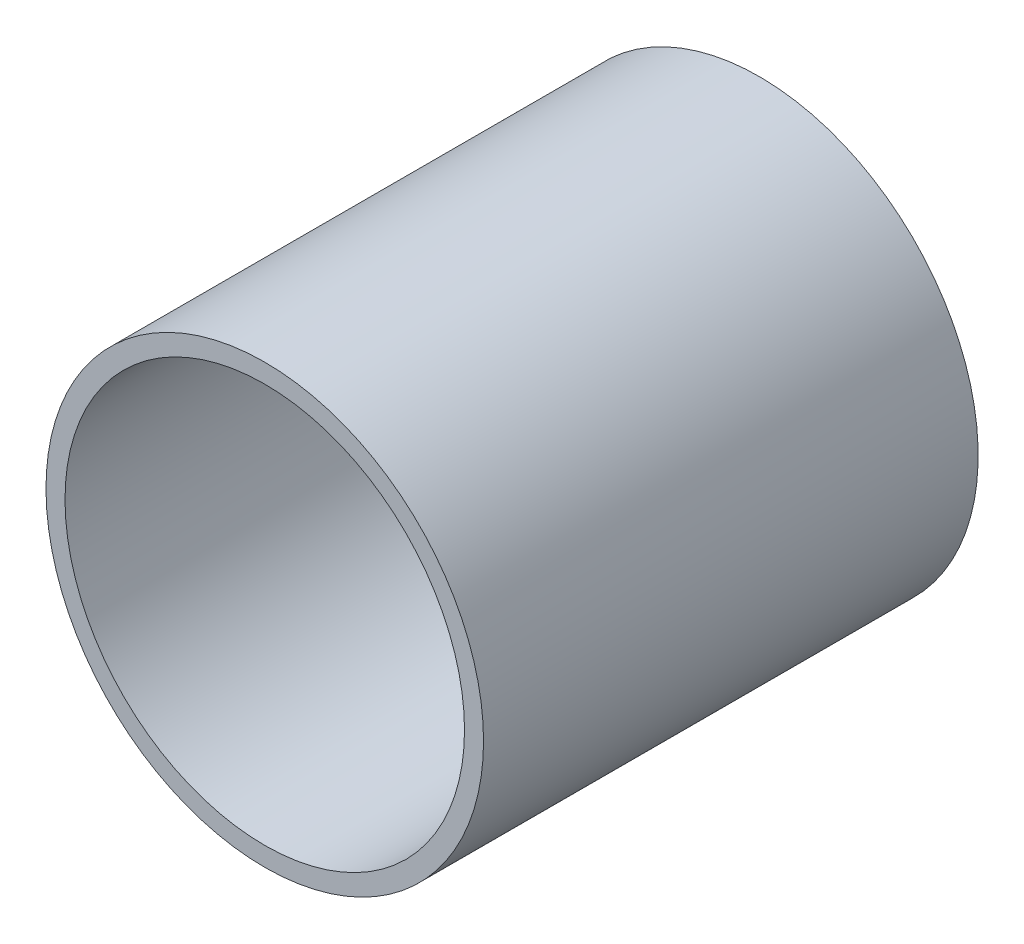
ISO-10303-21;
HEADER;
FILE_DESCRIPTION(('STEP AP214'),'2;1');
FILE_NAME('part.step','',(''),(''),'','','');
FILE_SCHEMA(('AUTOMOTIVE_DESIGN { 1 0 10303 214 1 1 1 1 }'));
ENDSEC;
DATA;
#1=APPLICATION_CONTEXT('core data for automotive mechanical design processes');
#2=APPLICATION_PROTOCOL_DEFINITION('international standard','automotive_design',2000,#1);
#3=PRODUCT_CONTEXT('',#1,'mechanical');
#4=PRODUCT('Part','Part','',(#3));
#5=PRODUCT_RELATED_PRODUCT_CATEGORY('part','',(#4));
#6=PRODUCT_DEFINITION_FORMATION('','',#4);
#7=PRODUCT_DEFINITION_CONTEXT('part definition',#1,'design');
#8=PRODUCT_DEFINITION('design','',#6,#7);
#9=PRODUCT_DEFINITION_SHAPE('','',#8);
#10=(LENGTH_UNIT() NAMED_UNIT(*) SI_UNIT(.MILLI.,.METRE.));
#11=(NAMED_UNIT(*) PLANE_ANGLE_UNIT() SI_UNIT($,.RADIAN.));
#12=(NAMED_UNIT(*) SI_UNIT($,.STERADIAN.) SOLID_ANGLE_UNIT());
#13=UNCERTAINTY_MEASURE_WITH_UNIT(LENGTH_MEASURE(1.E-05),#10,'distance_accuracy_value','');
#14=(GEOMETRIC_REPRESENTATION_CONTEXT(3) GLOBAL_UNCERTAINTY_ASSIGNED_CONTEXT((#13)) GLOBAL_UNIT_ASSIGNED_CONTEXT((#10,
#11,#12)) REPRESENTATION_CONTEXT('',''));
#15=CARTESIAN_POINT('',(0.,0.,0.));
#16=DIRECTION('',(0.,0.,1.));
#17=DIRECTION('',(1.,0.,0.));
#18=AXIS2_PLACEMENT_3D('',#15,#16,#17);
#19=CARTESIAN_POINT('',(0.,0.,260.));
#20=DIRECTION('',(0.,0.,1.));
#21=DIRECTION('',(1.,0.,0.));
#22=AXIS2_PLACEMENT_3D('',#19,#20,#21);
#23=PLANE('',#22);
#24=CARTESIAN_POINT('',(0.,0.,260.));
#25=DIRECTION('',(0.,0.,1.));
#26=DIRECTION('',(1.,0.,0.));
#27=AXIS2_PLACEMENT_3D('',#24,#25,#26);
#28=CIRCLE('',#27,115.);
#29=CARTESIAN_POINT('',(115.,0.,260.));
#30=VERTEX_POINT('',#29);
#31=EDGE_CURVE('E11',#30,#30,#28,.T.);
#32=ORIENTED_EDGE('',*,*,#31,.T.);
#33=EDGE_LOOP('',(#32));
#34=FACE_BOUND('',#33,.T.);
#35=CARTESIAN_POINT('',(0.,0.,260.));
#36=DIRECTION('',(0.,0.,1.));
#37=DIRECTION('',(1.,0.,0.));
#38=AXIS2_PLACEMENT_3D('',#35,#36,#37);
#39=CIRCLE('',#38,105.);
#40=CARTESIAN_POINT('',(105.,0.,260.));
#41=VERTEX_POINT('',#40);
#42=EDGE_CURVE('E91',#41,#41,#39,.T.);
#43=ORIENTED_EDGE('',*,*,#42,.F.);
#44=EDGE_LOOP('',(#43));
#45=FACE_BOUND('',#44,.T.);
#46=ADVANCED_FACE('F31',(#34,#45),#23,.T.);
#47=CARTESIAN_POINT('',(0.,0.,0.));
#48=DIRECTION('',(0.,0.,1.));
#49=DIRECTION('',(1.,0.,0.));
#50=AXIS2_PLACEMENT_3D('',#47,#48,#49);
#51=PLANE('',#50);
#52=CARTESIAN_POINT('',(0.,0.,0.));
#53=DIRECTION('',(0.,0.,1.));
#54=DIRECTION('',(1.,0.,0.));
#55=AXIS2_PLACEMENT_3D('',#52,#53,#54);
#56=CIRCLE('',#55,115.);
#57=CARTESIAN_POINT('',(-114.755174175285,-7.49999999999999,0.));
#58=VERTEX_POINT('',#57);
#59=CARTESIAN_POINT('',(-114.755174175285,7.50000000000001,0.));
#60=VERTEX_POINT('',#59);
#61=EDGE_CURVE('E35',#58,#60,#56,.T.);
#62=ORIENTED_EDGE('',*,*,#61,.F.);
#63=DIRECTION('',(1.,0.,0.));
#64=VECTOR('',#63,1.);
#65=CARTESIAN_POINT('',(-115.001,-7.49999999999999,0.));
#66=LINE('',#65,#64);
#67=CARTESIAN_POINT('',(-104.731800328267,-7.49999999999999,0.));
#68=VERTEX_POINT('',#67);
#69=EDGE_CURVE('E54',#58,#68,#66,.T.);
#70=ORIENTED_EDGE('',*,*,#69,.T.);
#71=CARTESIAN_POINT('',(0.,0.,0.));
#72=DIRECTION('',(0.,0.,1.));
#73=DIRECTION('',(1.,0.,0.));
#74=AXIS2_PLACEMENT_3D('',#71,#72,#73);
#75=CIRCLE('',#74,105.);
#76=CARTESIAN_POINT('',(-104.731800328267,7.50000000000001,0.));
#77=VERTEX_POINT('',#76);
#78=EDGE_CURVE('E85',#68,#77,#75,.T.);
#79=ORIENTED_EDGE('',*,*,#78,.T.);
#80=DIRECTION('',(1.,0.,0.));
#81=VECTOR('',#80,1.);
#82=CARTESIAN_POINT('',(-115.001,7.50000000000001,0.));
#83=LINE('',#82,#81);
#84=EDGE_CURVE('E46',#60,#77,#83,.T.);
#85=ORIENTED_EDGE('',*,*,#84,.F.);
#86=EDGE_LOOP('',(#62,#70,#79,#85));
#87=FACE_BOUND('',#86,.T.);
#88=ADVANCED_FACE('F84',(#87),#51,.F.);
#89=CARTESIAN_POINT('',(0.,0.,260.));
#90=DIRECTION('',(0.,0.,-1.));
#91=DIRECTION('',(-1.,0.,0.));
#92=AXIS2_PLACEMENT_3D('',#89,#90,#91);
#93=CYLINDRICAL_SURFACE('',#92,115.);
#94=ORIENTED_EDGE('',*,*,#31,.F.);
#95=EDGE_LOOP('',(#94));
#96=FACE_BOUND('',#95,.T.);
#97=CARTESIAN_POINT('',(0.,0.,2.));
#98=DIRECTION('',(0.,0.,1.));
#99=DIRECTION('',(0.,-1.,0.));
#100=AXIS2_PLACEMENT_3D('',#97,#98,#99);
#101=CIRCLE('',#100,115.);
#102=CARTESIAN_POINT('',(-114.755174175285,-7.49999999999999,2.));
#103=VERTEX_POINT('',#102);
#104=CARTESIAN_POINT('',(-114.755174175285,7.50000000000001,2.));
#105=VERTEX_POINT('',#104);
#106=EDGE_CURVE('E78',#103,#105,#101,.F.);
#107=ORIENTED_EDGE('',*,*,#106,.F.);
#108=DIRECTION('',(0.,0.,-1.));
#109=VECTOR('',#108,1.);
#110=CARTESIAN_POINT('',(-114.755174175285,-7.49999999999999,260.));
#111=LINE('',#110,#109);
#112=EDGE_CURVE('E101',#58,#103,#111,.F.);
#113=ORIENTED_EDGE('',*,*,#112,.F.);
#114=ORIENTED_EDGE('',*,*,#61,.T.);
#115=DIRECTION('',(0.,0.,-1.));
#116=VECTOR('',#115,1.);
#117=CARTESIAN_POINT('',(-114.755174175285,7.50000000000001,260.));
#118=LINE('',#117,#116);
#119=EDGE_CURVE('E92',#105,#60,#118,.T.);
#120=ORIENTED_EDGE('',*,*,#119,.F.);
#121=EDGE_LOOP('',(#107,#113,#114,#120));
#122=FACE_BOUND('',#121,.T.);
#123=ADVANCED_FACE('F33',(#96,#122),#93,.T.);
#124=CARTESIAN_POINT('',(0.,0.,260.));
#125=DIRECTION('',(0.,0.,-1.));
#126=DIRECTION('',(-1.,0.,0.));
#127=AXIS2_PLACEMENT_3D('',#124,#125,#126);
#128=CYLINDRICAL_SURFACE('',#127,105.);
#129=DIRECTION('',(0.,0.,-1.));
#130=VECTOR('',#129,1.);
#131=CARTESIAN_POINT('',(-104.731800328267,-7.49999999999999,260.));
#132=LINE('',#131,#130);
#133=CARTESIAN_POINT('',(-104.731800328267,-7.49999999999999,2.));
#134=VERTEX_POINT('',#133);
#135=EDGE_CURVE('E72',#68,#134,#132,.F.);
#136=ORIENTED_EDGE('',*,*,#135,.T.);
#137=CARTESIAN_POINT('',(0.,0.,2.));
#138=DIRECTION('',(0.,0.,1.));
#139=DIRECTION('',(0.,-1.,0.));
#140=AXIS2_PLACEMENT_3D('',#137,#138,#139);
#141=CIRCLE('',#140,105.);
#142=CARTESIAN_POINT('',(-104.731800328267,7.50000000000001,2.));
#143=VERTEX_POINT('',#142);
#144=EDGE_CURVE('E79',#134,#143,#141,.F.);
#145=ORIENTED_EDGE('',*,*,#144,.T.);
#146=DIRECTION('',(0.,0.,-1.));
#147=VECTOR('',#146,1.);
#148=CARTESIAN_POINT('',(-104.731800328267,7.50000000000001,260.));
#149=LINE('',#148,#147);
#150=EDGE_CURVE('E87',#143,#77,#149,.T.);
#151=ORIENTED_EDGE('',*,*,#150,.T.);
#152=ORIENTED_EDGE('',*,*,#78,.F.);
#153=EDGE_LOOP('',(#136,#145,#151,#152));
#154=FACE_BOUND('',#153,.T.);
#155=ORIENTED_EDGE('',*,*,#42,.T.);
#156=EDGE_LOOP('',(#155));
#157=FACE_BOUND('',#156,.T.);
#158=ADVANCED_FACE('F89',(#154,#157),#128,.F.);
#159=CARTESIAN_POINT('',(-115.001,-7.49999999999999,0.));
#160=DIRECTION('',(0.,-1.,0.));
#161=DIRECTION('',(0.,0.,-1.));
#162=AXIS2_PLACEMENT_3D('',#159,#160,#161);
#163=PLANE('',#162);
#164=ORIENTED_EDGE('',*,*,#112,.T.);
#165=DIRECTION('',(1.,0.,0.));
#166=VECTOR('',#165,1.);
#167=CARTESIAN_POINT('',(-115.001,-7.49999999999999,2.));
#168=LINE('',#167,#166);
#169=EDGE_CURVE('E74',#103,#134,#168,.T.);
#170=ORIENTED_EDGE('',*,*,#169,.T.);
#171=ORIENTED_EDGE('',*,*,#135,.F.);
#172=ORIENTED_EDGE('',*,*,#69,.F.);
#173=EDGE_LOOP('',(#164,#170,#171,#172));
#174=FACE_BOUND('',#173,.T.);
#175=ADVANCED_FACE('F73',(#174),#163,.F.);
#176=CARTESIAN_POINT('',(-115.001,7.50000000000001,2.));
#177=DIRECTION('',(0.,0.,1.));
#178=DIRECTION('',(0.,-1.,0.));
#179=AXIS2_PLACEMENT_3D('',#176,#177,#178);
#180=PLANE('',#179);
#181=ORIENTED_EDGE('',*,*,#106,.T.);
#182=DIRECTION('',(1.,0.,0.));
#183=VECTOR('',#182,1.);
#184=CARTESIAN_POINT('',(-115.001,7.50000000000001,2.));
#185=LINE('',#184,#183);
#186=EDGE_CURVE('E100',#105,#143,#185,.T.);
#187=ORIENTED_EDGE('',*,*,#186,.T.);
#188=ORIENTED_EDGE('',*,*,#144,.F.);
#189=ORIENTED_EDGE('',*,*,#169,.F.);
#190=EDGE_LOOP('',(#181,#187,#188,#189));
#191=FACE_BOUND('',#190,.T.);
#192=ADVANCED_FACE('F109',(#191),#180,.F.);
#193=CARTESIAN_POINT('',(-115.001,7.50000000000001,0.));
#194=DIRECTION('',(0.,1.,0.));
#195=DIRECTION('',(0.,0.,1.));
#196=AXIS2_PLACEMENT_3D('',#193,#194,#195);
#197=PLANE('',#196);
#198=ORIENTED_EDGE('',*,*,#119,.T.);
#199=ORIENTED_EDGE('',*,*,#84,.T.);
#200=ORIENTED_EDGE('',*,*,#150,.F.);
#201=ORIENTED_EDGE('',*,*,#186,.F.);
#202=EDGE_LOOP('',(#198,#199,#200,#201));
#203=FACE_BOUND('',#202,.T.);
#204=ADVANCED_FACE('F112',(#203),#197,.F.);
#205=CLOSED_SHELL('',(#46,#88,#123,#158,#175,#192,#204));
#206=MANIFOLD_SOLID_BREP('B2',#205);
#207=ADVANCED_BREP_SHAPE_REPRESENTATION('',(#18,#206),#14);
#208=SHAPE_DEFINITION_REPRESENTATION(#9,#207);
ENDSEC;
END-ISO-10303-21;
